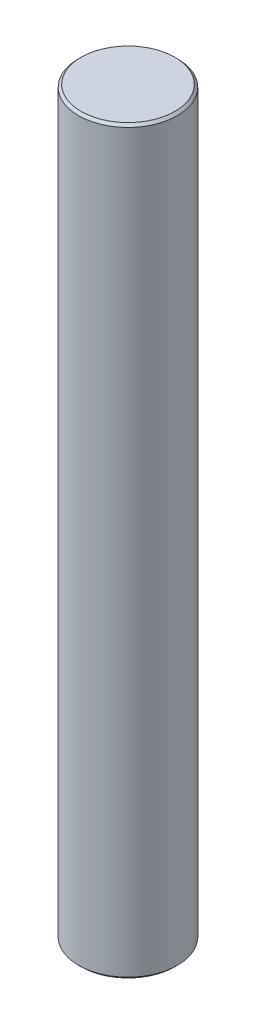
ISO-10303-21;
HEADER;
FILE_DESCRIPTION(('STEP AP214'),'2;1');
FILE_NAME('part.step','',(''),(''),'','','');
FILE_SCHEMA(('AUTOMOTIVE_DESIGN { 1 0 10303 214 1 1 1 1 }'));
ENDSEC;
DATA;
#1=APPLICATION_CONTEXT('core data for automotive mechanical design processes');
#2=APPLICATION_PROTOCOL_DEFINITION('international standard','automotive_design',2000,#1);
#3=PRODUCT_CONTEXT('',#1,'mechanical');
#4=PRODUCT('Part','Part','',(#3));
#5=PRODUCT_RELATED_PRODUCT_CATEGORY('part','',(#4));
#6=PRODUCT_DEFINITION_FORMATION('','',#4);
#7=PRODUCT_DEFINITION_CONTEXT('part definition',#1,'design');
#8=PRODUCT_DEFINITION('design','',#6,#7);
#9=PRODUCT_DEFINITION_SHAPE('','',#8);
#10=(LENGTH_UNIT() NAMED_UNIT(*) SI_UNIT(.MILLI.,.METRE.));
#11=(NAMED_UNIT(*) PLANE_ANGLE_UNIT() SI_UNIT($,.RADIAN.));
#12=(NAMED_UNIT(*) SI_UNIT($,.STERADIAN.) SOLID_ANGLE_UNIT());
#13=UNCERTAINTY_MEASURE_WITH_UNIT(LENGTH_MEASURE(1.E-05),#10,'distance_accuracy_value','');
#14=(GEOMETRIC_REPRESENTATION_CONTEXT(3) GLOBAL_UNCERTAINTY_ASSIGNED_CONTEXT((#13)) GLOBAL_UNIT_ASSIGNED_CONTEXT((#10,
#11,#12)) REPRESENTATION_CONTEXT('',''));
#15=CARTESIAN_POINT('',(0.,0.,0.));
#16=DIRECTION('',(0.,0.,1.));
#17=DIRECTION('',(1.,0.,0.));
#18=AXIS2_PLACEMENT_3D('',#15,#16,#17);
#19=CARTESIAN_POINT('',(0.,30.,0.));
#20=DIRECTION('',(0.,-1.,0.));
#21=DIRECTION('',(0.,0.,-1.));
#22=AXIS2_PLACEMENT_3D('',#19,#20,#21);
#23=CYLINDRICAL_SURFACE('',#22,2.);
#24=CARTESIAN_POINT('',(0.,0.0999999999999959,0.));
#25=DIRECTION('',(0.,1.,0.));
#26=DIRECTION('',(0.,0.,1.));
#27=AXIS2_PLACEMENT_3D('',#24,#25,#26);
#28=CIRCLE('',#27,2.);
#29=CARTESIAN_POINT('',(0.,0.0999999999999959,2.));
#30=VERTEX_POINT('',#29);
#31=EDGE_CURVE('E41',#30,#30,#28,.T.);
#32=ORIENTED_EDGE('',*,*,#31,.T.);
#33=EDGE_LOOP('',(#32));
#34=FACE_BOUND('',#33,.T.);
#35=CARTESIAN_POINT('',(0.,29.9,0.));
#36=DIRECTION('',(0.,1.,0.));
#37=DIRECTION('',(0.,0.,1.));
#38=AXIS2_PLACEMENT_3D('',#35,#36,#37);
#39=CIRCLE('',#38,2.);
#40=CARTESIAN_POINT('',(0.,29.9,2.));
#41=VERTEX_POINT('',#40);
#42=EDGE_CURVE('E45',#41,#41,#39,.F.);
#43=ORIENTED_EDGE('',*,*,#42,.T.);
#44=EDGE_LOOP('',(#43));
#45=FACE_BOUND('',#44,.T.);
#46=ADVANCED_FACE('F30',(#34,#45),#23,.T.);
#47=CARTESIAN_POINT('',(0.,30.,0.));
#48=DIRECTION('',(0.,1.,0.));
#49=DIRECTION('',(0.,0.,1.));
#50=AXIS2_PLACEMENT_3D('',#47,#48,#49);
#51=PLANE('',#50);
#52=CARTESIAN_POINT('',(0.,30.,0.));
#53=DIRECTION('',(0.,1.,0.));
#54=DIRECTION('',(0.,0.,1.));
#55=AXIS2_PLACEMENT_3D('',#52,#53,#54);
#56=CIRCLE('',#55,1.90000000000001);
#57=CARTESIAN_POINT('',(0.,30.,1.90000000000001));
#58=VERTEX_POINT('',#57);
#59=EDGE_CURVE('E10',#58,#58,#56,.T.);
#60=ORIENTED_EDGE('',*,*,#59,.T.);
#61=EDGE_LOOP('',(#60));
#62=FACE_BOUND('',#61,.T.);
#63=ADVANCED_FACE('F61',(#62),#51,.T.);
#64=CARTESIAN_POINT('',(0.,0.,0.));
#65=DIRECTION('',(0.,1.,0.));
#66=DIRECTION('',(0.,0.,1.));
#67=AXIS2_PLACEMENT_3D('',#64,#65,#66);
#68=PLANE('',#67);
#69=CARTESIAN_POINT('',(0.,0.,0.));
#70=DIRECTION('',(0.,1.,0.));
#71=DIRECTION('',(0.,0.,1.));
#72=AXIS2_PLACEMENT_3D('',#69,#70,#71);
#73=CIRCLE('',#72,1.9);
#74=CARTESIAN_POINT('',(0.,0.,1.9));
#75=VERTEX_POINT('',#74);
#76=EDGE_CURVE('E37',#75,#75,#73,.F.);
#77=ORIENTED_EDGE('',*,*,#76,.T.);
#78=EDGE_LOOP('',(#77));
#79=FACE_BOUND('',#78,.T.);
#80=ADVANCED_FACE('F58',(#79),#68,.F.);
#81=CARTESIAN_POINT('',(0.,0.0999999999999959,0.));
#82=DIRECTION('',(0.,1.,0.));
#83=DIRECTION('',(0.,0.,1.));
#84=AXIS2_PLACEMENT_3D('',#81,#82,#83);
#85=CONICAL_SURFACE('',#84,2.,0.785398163397474);
#86=ORIENTED_EDGE('',*,*,#76,.F.);
#87=EDGE_LOOP('',(#86));
#88=FACE_BOUND('',#87,.T.);
#89=ORIENTED_EDGE('',*,*,#31,.F.);
#90=EDGE_LOOP('',(#89));
#91=FACE_BOUND('',#90,.T.);
#92=ADVANCED_FACE('F54',(#88,#91),#85,.T.);
#93=CARTESIAN_POINT('',(0.,30.,0.));
#94=DIRECTION('',(0.,-1.,0.));
#95=DIRECTION('',(0.,0.,-1.));
#96=AXIS2_PLACEMENT_3D('',#93,#94,#95);
#97=CONICAL_SURFACE('',#96,1.90000000000001,0.78539816339744);
#98=ORIENTED_EDGE('',*,*,#42,.F.);
#99=EDGE_LOOP('',(#98));
#100=FACE_BOUND('',#99,.T.);
#101=ORIENTED_EDGE('',*,*,#59,.F.);
#102=EDGE_LOOP('',(#101));
#103=FACE_BOUND('',#102,.T.);
#104=ADVANCED_FACE('F32',(#100,#103),#97,.T.);
#105=CLOSED_SHELL('',(#46,#63,#80,#92,#104));
#106=MANIFOLD_SOLID_BREP('B2',#105);
#107=ADVANCED_BREP_SHAPE_REPRESENTATION('',(#18,#106),#14);
#108=SHAPE_DEFINITION_REPRESENTATION(#9,#107);
ENDSEC;
END-ISO-10303-21;
